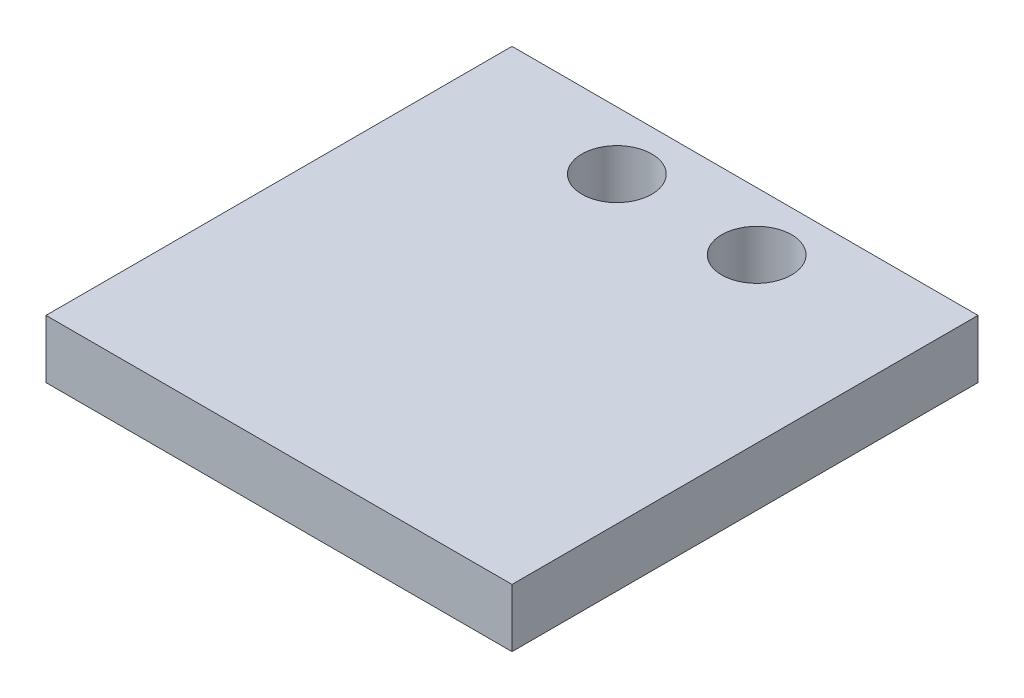
ISO-10303-21;
HEADER;
FILE_DESCRIPTION(('STEP AP214'),'2;1');
FILE_NAME('part.step','',(''),(''),'','','');
FILE_SCHEMA(('AUTOMOTIVE_DESIGN { 1 0 10303 214 1 1 1 1 }'));
ENDSEC;
DATA;
#1=APPLICATION_CONTEXT('core data for automotive mechanical design processes');
#2=APPLICATION_PROTOCOL_DEFINITION('international standard','automotive_design',2000,#1);
#3=PRODUCT_CONTEXT('',#1,'mechanical');
#4=PRODUCT('Part','Part','',(#3));
#5=PRODUCT_RELATED_PRODUCT_CATEGORY('part','',(#4));
#6=PRODUCT_DEFINITION_FORMATION('','',#4);
#7=PRODUCT_DEFINITION_CONTEXT('part definition',#1,'design');
#8=PRODUCT_DEFINITION('design','',#6,#7);
#9=PRODUCT_DEFINITION_SHAPE('','',#8);
#10=(LENGTH_UNIT() NAMED_UNIT(*) SI_UNIT(.MILLI.,.METRE.));
#11=(NAMED_UNIT(*) PLANE_ANGLE_UNIT() SI_UNIT($,.RADIAN.));
#12=(NAMED_UNIT(*) SI_UNIT($,.STERADIAN.) SOLID_ANGLE_UNIT());
#13=UNCERTAINTY_MEASURE_WITH_UNIT(LENGTH_MEASURE(1.E-05),#10,'distance_accuracy_value','');
#14=(GEOMETRIC_REPRESENTATION_CONTEXT(3) GLOBAL_UNCERTAINTY_ASSIGNED_CONTEXT((#13)) GLOBAL_UNIT_ASSIGNED_CONTEXT((#10,
#11,#12)) REPRESENTATION_CONTEXT('',''));
#15=CARTESIAN_POINT('',(0.,0.,0.));
#16=DIRECTION('',(0.,0.,1.));
#17=DIRECTION('',(1.,0.,0.));
#18=AXIS2_PLACEMENT_3D('',#15,#16,#17);
#19=CARTESIAN_POINT('',(0.,2.5,0.));
#20=DIRECTION('',(0.,1.,0.));
#21=DIRECTION('',(0.,0.,1.));
#22=AXIS2_PLACEMENT_3D('',#19,#20,#21);
#23=PLANE('',#22);
#24=CARTESIAN_POINT('',(-3.,2.5,-7.5));
#25=DIRECTION('',(0.,1.,0.));
#26=DIRECTION('',(0.,0.,1.));
#27=AXIS2_PLACEMENT_3D('',#24,#25,#26);
#28=CIRCLE('',#27,1.5);
#29=CARTESIAN_POINT('',(-3.,2.5,-6.));
#30=VERTEX_POINT('',#29);
#31=EDGE_CURVE('E116',#30,#30,#28,.T.);
#32=ORIENTED_EDGE('',*,*,#31,.F.);
#33=EDGE_LOOP('',(#32));
#34=FACE_BOUND('',#33,.T.);
#35=DIRECTION('',(0.,0.,-1.));
#36=VECTOR('',#35,1.);
#37=CARTESIAN_POINT('',(10.,2.5,-10.));
#38=LINE('',#37,#36);
#39=CARTESIAN_POINT('',(10.,2.5,10.));
#40=VERTEX_POINT('',#39);
#41=CARTESIAN_POINT('',(10.,2.5,-10.));
#42=VERTEX_POINT('',#41);
#43=EDGE_CURVE('E96',#40,#42,#38,.T.);
#44=ORIENTED_EDGE('',*,*,#43,.T.);
#45=DIRECTION('',(-1.,0.,0.));
#46=VECTOR('',#45,1.);
#47=CARTESIAN_POINT('',(-10.,2.5,-10.));
#48=LINE('',#47,#46);
#49=CARTESIAN_POINT('',(-10.,2.5,-10.));
#50=VERTEX_POINT('',#49);
#51=EDGE_CURVE('E91',#42,#50,#48,.T.);
#52=ORIENTED_EDGE('',*,*,#51,.T.);
#53=DIRECTION('',(0.,0.,1.));
#54=VECTOR('',#53,1.);
#55=CARTESIAN_POINT('',(-10.,2.5,-10.));
#56=LINE('',#55,#54);
#57=CARTESIAN_POINT('',(-10.,2.5,10.));
#58=VERTEX_POINT('',#57);
#59=EDGE_CURVE('E94',#50,#58,#56,.T.);
#60=ORIENTED_EDGE('',*,*,#59,.T.);
#61=DIRECTION('',(1.,0.,0.));
#62=VECTOR('',#61,1.);
#63=CARTESIAN_POINT('',(-10.,2.5,10.));
#64=LINE('',#63,#62);
#65=EDGE_CURVE('E61',#58,#40,#64,.T.);
#66=ORIENTED_EDGE('',*,*,#65,.T.);
#67=EDGE_LOOP('',(#44,#52,#60,#66));
#68=FACE_BOUND('',#67,.T.);
#69=CARTESIAN_POINT('',(3.,2.5,-7.5));
#70=DIRECTION('',(0.,1.,0.));
#71=DIRECTION('',(0.,0.,1.));
#72=AXIS2_PLACEMENT_3D('',#69,#70,#71);
#73=CIRCLE('',#72,1.5);
#74=CARTESIAN_POINT('',(3.,2.5,-6.));
#75=VERTEX_POINT('',#74);
#76=EDGE_CURVE('E138',#75,#75,#73,.T.);
#77=ORIENTED_EDGE('',*,*,#76,.F.);
#78=EDGE_LOOP('',(#77));
#79=FACE_BOUND('',#78,.T.);
#80=ADVANCED_FACE('F43',(#34,#68,#79),#23,.T.);
#81=CARTESIAN_POINT('',(0.,0.,0.));
#82=DIRECTION('',(0.,1.,0.));
#83=DIRECTION('',(0.,0.,1.));
#84=AXIS2_PLACEMENT_3D('',#81,#82,#83);
#85=PLANE('',#84);
#86=DIRECTION('',(0.,0.,-1.));
#87=VECTOR('',#86,1.);
#88=CARTESIAN_POINT('',(10.,0.,-10.));
#89=LINE('',#88,#87);
#90=CARTESIAN_POINT('',(10.,0.,10.));
#91=VERTEX_POINT('',#90);
#92=CARTESIAN_POINT('',(10.,0.,-10.));
#93=VERTEX_POINT('',#92);
#94=EDGE_CURVE('E112',#91,#93,#89,.T.);
#95=ORIENTED_EDGE('',*,*,#94,.F.);
#96=DIRECTION('',(1.,0.,0.));
#97=VECTOR('',#96,1.);
#98=CARTESIAN_POINT('',(-10.,0.,10.));
#99=LINE('',#98,#97);
#100=CARTESIAN_POINT('',(-10.,0.,10.));
#101=VERTEX_POINT('',#100);
#102=EDGE_CURVE('E84',#101,#91,#99,.T.);
#103=ORIENTED_EDGE('',*,*,#102,.F.);
#104=DIRECTION('',(0.,0.,1.));
#105=VECTOR('',#104,1.);
#106=CARTESIAN_POINT('',(-10.,0.,-10.));
#107=LINE('',#106,#105);
#108=CARTESIAN_POINT('',(-10.,0.,-10.));
#109=VERTEX_POINT('',#108);
#110=EDGE_CURVE('E78',#109,#101,#107,.T.);
#111=ORIENTED_EDGE('',*,*,#110,.F.);
#112=DIRECTION('',(-1.,0.,0.));
#113=VECTOR('',#112,1.);
#114=CARTESIAN_POINT('',(-10.,0.,-10.));
#115=LINE('',#114,#113);
#116=EDGE_CURVE('E101',#93,#109,#115,.T.);
#117=ORIENTED_EDGE('',*,*,#116,.F.);
#118=EDGE_LOOP('',(#95,#103,#111,#117));
#119=FACE_BOUND('',#118,.T.);
#120=CARTESIAN_POINT('',(-3.,0.,-7.5));
#121=DIRECTION('',(0.,1.,0.));
#122=DIRECTION('',(0.,0.,1.));
#123=AXIS2_PLACEMENT_3D('',#120,#121,#122);
#124=CIRCLE('',#123,1.5);
#125=CARTESIAN_POINT('',(-3.,0.,-6.));
#126=VERTEX_POINT('',#125);
#127=EDGE_CURVE('E134',#126,#126,#124,.T.);
#128=ORIENTED_EDGE('',*,*,#127,.T.);
#129=EDGE_LOOP('',(#128));
#130=FACE_BOUND('',#129,.T.);
#131=CARTESIAN_POINT('',(3.,0.,-7.5));
#132=DIRECTION('',(0.,1.,0.));
#133=DIRECTION('',(0.,0.,1.));
#134=AXIS2_PLACEMENT_3D('',#131,#132,#133);
#135=CIRCLE('',#134,1.5);
#136=CARTESIAN_POINT('',(3.,0.,-6.));
#137=VERTEX_POINT('',#136);
#138=EDGE_CURVE('E142',#137,#137,#135,.T.);
#139=ORIENTED_EDGE('',*,*,#138,.T.);
#140=EDGE_LOOP('',(#139));
#141=FACE_BOUND('',#140,.T.);
#142=ADVANCED_FACE('F129',(#119,#130,#141),#85,.F.);
#143=CARTESIAN_POINT('',(10.,2.5,-10.));
#144=DIRECTION('',(-1.,0.,0.));
#145=DIRECTION('',(0.,0.,1.));
#146=AXIS2_PLACEMENT_3D('',#143,#144,#145);
#147=PLANE('',#146);
#148=ORIENTED_EDGE('',*,*,#94,.T.);
#149=DIRECTION('',(0.,-1.,0.));
#150=VECTOR('',#149,1.);
#151=CARTESIAN_POINT('',(10.,2.5,-10.));
#152=LINE('',#151,#150);
#153=EDGE_CURVE('E11',#42,#93,#152,.T.);
#154=ORIENTED_EDGE('',*,*,#153,.F.);
#155=ORIENTED_EDGE('',*,*,#43,.F.);
#156=DIRECTION('',(0.,-1.,0.));
#157=VECTOR('',#156,1.);
#158=CARTESIAN_POINT('',(10.,2.5,10.));
#159=LINE('',#158,#157);
#160=EDGE_CURVE('E108',#40,#91,#159,.T.);
#161=ORIENTED_EDGE('',*,*,#160,.T.);
#162=EDGE_LOOP('',(#148,#154,#155,#161));
#163=FACE_BOUND('',#162,.T.);
#164=ADVANCED_FACE('F45',(#163),#147,.F.);
#165=CARTESIAN_POINT('',(-10.,2.5,-10.));
#166=DIRECTION('',(0.,0.,1.));
#167=DIRECTION('',(1.,0.,0.));
#168=AXIS2_PLACEMENT_3D('',#165,#166,#167);
#169=PLANE('',#168);
#170=ORIENTED_EDGE('',*,*,#116,.T.);
#171=DIRECTION('',(0.,-1.,0.));
#172=VECTOR('',#171,1.);
#173=CARTESIAN_POINT('',(-10.,2.5,-10.));
#174=LINE('',#173,#172);
#175=EDGE_CURVE('E53',#50,#109,#174,.T.);
#176=ORIENTED_EDGE('',*,*,#175,.F.);
#177=ORIENTED_EDGE('',*,*,#51,.F.);
#178=ORIENTED_EDGE('',*,*,#153,.T.);
#179=EDGE_LOOP('',(#170,#176,#177,#178));
#180=FACE_BOUND('',#179,.T.);
#181=ADVANCED_FACE('F100',(#180),#169,.F.);
#182=CARTESIAN_POINT('',(-10.,2.5,-10.));
#183=DIRECTION('',(1.,0.,0.));
#184=DIRECTION('',(0.,0.,-1.));
#185=AXIS2_PLACEMENT_3D('',#182,#183,#184);
#186=PLANE('',#185);
#187=ORIENTED_EDGE('',*,*,#110,.T.);
#188=DIRECTION('',(0.,-1.,0.));
#189=VECTOR('',#188,1.);
#190=CARTESIAN_POINT('',(-10.,2.5,10.));
#191=LINE('',#190,#189);
#192=EDGE_CURVE('E103',#58,#101,#191,.T.);
#193=ORIENTED_EDGE('',*,*,#192,.F.);
#194=ORIENTED_EDGE('',*,*,#59,.F.);
#195=ORIENTED_EDGE('',*,*,#175,.T.);
#196=EDGE_LOOP('',(#187,#193,#194,#195));
#197=FACE_BOUND('',#196,.T.);
#198=ADVANCED_FACE('F104',(#197),#186,.F.);
#199=CARTESIAN_POINT('',(-10.,2.5,10.));
#200=DIRECTION('',(0.,0.,-1.));
#201=DIRECTION('',(-1.,0.,0.));
#202=AXIS2_PLACEMENT_3D('',#199,#200,#201);
#203=PLANE('',#202);
#204=ORIENTED_EDGE('',*,*,#102,.T.);
#205=ORIENTED_EDGE('',*,*,#160,.F.);
#206=ORIENTED_EDGE('',*,*,#65,.F.);
#207=ORIENTED_EDGE('',*,*,#192,.T.);
#208=EDGE_LOOP('',(#204,#205,#206,#207));
#209=FACE_BOUND('',#208,.T.);
#210=ADVANCED_FACE('F126',(#209),#203,.F.);
#211=CARTESIAN_POINT('',(-3.,2.5,-7.5));
#212=DIRECTION('',(0.,-1.,0.));
#213=DIRECTION('',(0.,0.,-1.));
#214=AXIS2_PLACEMENT_3D('',#211,#212,#213);
#215=CYLINDRICAL_SURFACE('',#214,1.5);
#216=ORIENTED_EDGE('',*,*,#31,.T.);
#217=EDGE_LOOP('',(#216));
#218=FACE_BOUND('',#217,.T.);
#219=ORIENTED_EDGE('',*,*,#127,.F.);
#220=EDGE_LOOP('',(#219));
#221=FACE_BOUND('',#220,.T.);
#222=ADVANCED_FACE('F161',(#218,#221),#215,.F.);
#223=CARTESIAN_POINT('',(3.,2.5,-7.5));
#224=DIRECTION('',(0.,-1.,0.));
#225=DIRECTION('',(0.,0.,-1.));
#226=AXIS2_PLACEMENT_3D('',#223,#224,#225);
#227=CYLINDRICAL_SURFACE('',#226,1.5);
#228=ORIENTED_EDGE('',*,*,#76,.T.);
#229=EDGE_LOOP('',(#228));
#230=FACE_BOUND('',#229,.T.);
#231=ORIENTED_EDGE('',*,*,#138,.F.);
#232=EDGE_LOOP('',(#231));
#233=FACE_BOUND('',#232,.T.);
#234=ADVANCED_FACE('F150',(#230,#233),#227,.F.);
#235=CLOSED_SHELL('',(#80,#142,#164,#181,#198,#210,#222,#234));
#236=MANIFOLD_SOLID_BREP('B2',#235);
#237=ADVANCED_BREP_SHAPE_REPRESENTATION('',(#18,#236),#14);
#238=SHAPE_DEFINITION_REPRESENTATION(#9,#237);
ENDSEC;
END-ISO-10303-21;
